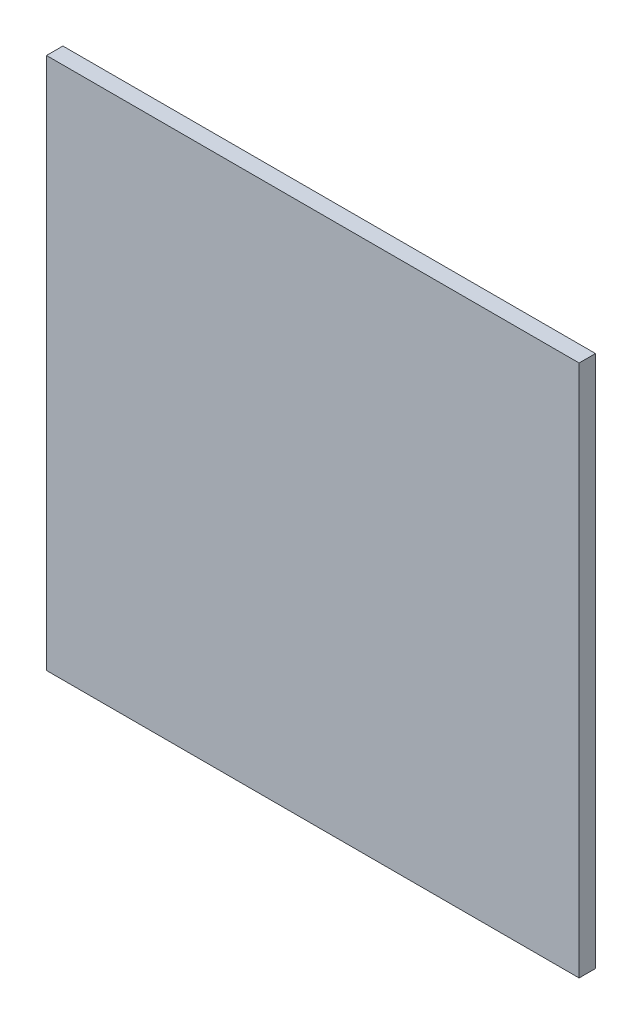
ISO-10303-21;
HEADER;
FILE_DESCRIPTION(('STEP AP214'),'2;1');
FILE_NAME('part.step','',(''),(''),'','','');
FILE_SCHEMA(('AUTOMOTIVE_DESIGN { 1 0 10303 214 1 1 1 1 }'));
ENDSEC;
DATA;
#1=APPLICATION_CONTEXT('core data for automotive mechanical design processes');
#2=APPLICATION_PROTOCOL_DEFINITION('international standard','automotive_design',2000,#1);
#3=PRODUCT_CONTEXT('',#1,'mechanical');
#4=PRODUCT('Part','Part','',(#3));
#5=PRODUCT_RELATED_PRODUCT_CATEGORY('part','',(#4));
#6=PRODUCT_DEFINITION_FORMATION('','',#4);
#7=PRODUCT_DEFINITION_CONTEXT('part definition',#1,'design');
#8=PRODUCT_DEFINITION('design','',#6,#7);
#9=PRODUCT_DEFINITION_SHAPE('','',#8);
#10=(LENGTH_UNIT() NAMED_UNIT(*) SI_UNIT(.MILLI.,.METRE.));
#11=(NAMED_UNIT(*) PLANE_ANGLE_UNIT() SI_UNIT($,.RADIAN.));
#12=(NAMED_UNIT(*) SI_UNIT($,.STERADIAN.) SOLID_ANGLE_UNIT());
#13=UNCERTAINTY_MEASURE_WITH_UNIT(LENGTH_MEASURE(1.E-05),#10,'distance_accuracy_value','');
#14=(GEOMETRIC_REPRESENTATION_CONTEXT(3) GLOBAL_UNCERTAINTY_ASSIGNED_CONTEXT((#13)) GLOBAL_UNIT_ASSIGNED_CONTEXT((#10,
#11,#12)) REPRESENTATION_CONTEXT('',''));
#15=CARTESIAN_POINT('',(0.,0.,0.));
#16=DIRECTION('',(0.,0.,1.));
#17=DIRECTION('',(1.,0.,0.));
#18=AXIS2_PLACEMENT_3D('',#15,#16,#17);
#19=CARTESIAN_POINT('',(0.16250158,0.16250158,0.00999998));
#20=DIRECTION('',(0.,0.,1.));
#21=DIRECTION('',(1.,0.,0.));
#22=AXIS2_PLACEMENT_3D('',#19,#20,#21);
#23=PLANE('',#22);
#24=DIRECTION('',(1.,0.,0.));
#25=VECTOR('',#24,1.);
#26=CARTESIAN_POINT('',(-0.16249904,0.16250158,0.00999998));
#27=LINE('',#26,#25);
#28=CARTESIAN_POINT('',(-0.16249904,0.16250158,0.00999998));
#29=VERTEX_POINT('',#28);
#30=CARTESIAN_POINT('',(0.16250158,0.16250158,0.00999998));
#31=VERTEX_POINT('',#30);
#32=EDGE_CURVE('E26',#29,#31,#27,.T.);
#33=ORIENTED_EDGE('',*,*,#32,.F.);
#34=DIRECTION('',(0.,1.,0.));
#35=VECTOR('',#34,1.);
#36=CARTESIAN_POINT('',(-0.16249904,-0.16249904,0.00999998));
#37=LINE('',#36,#35);
#38=CARTESIAN_POINT('',(-0.16249904,-0.16249904,0.00999998));
#39=VERTEX_POINT('',#38);
#40=EDGE_CURVE('E80',#39,#29,#37,.T.);
#41=ORIENTED_EDGE('',*,*,#40,.F.);
#42=DIRECTION('',(-1.,0.,0.));
#43=VECTOR('',#42,1.);
#44=CARTESIAN_POINT('',(0.16250158,-0.16249904,0.00999998));
#45=LINE('',#44,#43);
#46=CARTESIAN_POINT('',(0.16250158,-0.16249904,0.00999998));
#47=VERTEX_POINT('',#46);
#48=EDGE_CURVE('E83',#47,#39,#45,.T.);
#49=ORIENTED_EDGE('',*,*,#48,.F.);
#50=DIRECTION('',(0.,-1.,0.));
#51=VECTOR('',#50,1.);
#52=CARTESIAN_POINT('',(0.16250158,0.16250158,0.00999998));
#53=LINE('',#52,#51);
#54=EDGE_CURVE('E109',#31,#47,#53,.T.);
#55=ORIENTED_EDGE('',*,*,#54,.F.);
#56=EDGE_LOOP('',(#33,#41,#49,#55));
#57=FACE_BOUND('',#56,.T.);
#58=ADVANCED_FACE('F17',(#57),#23,.T.);
#59=CARTESIAN_POINT('',(0.16250158,0.16250158,0.));
#60=DIRECTION('',(0.,0.,1.));
#61=DIRECTION('',(1.,0.,0.));
#62=AXIS2_PLACEMENT_3D('',#59,#60,#61);
#63=PLANE('',#62);
#64=DIRECTION('',(0.,-1.,0.));
#65=VECTOR('',#64,1.);
#66=CARTESIAN_POINT('',(0.16250158,0.16250158,0.));
#67=LINE('',#66,#65);
#68=CARTESIAN_POINT('',(0.16250158,0.16250158,0.));
#69=VERTEX_POINT('',#68);
#70=CARTESIAN_POINT('',(0.16250158,-0.16249904,0.));
#71=VERTEX_POINT('',#70);
#72=EDGE_CURVE('E75',#69,#71,#67,.T.);
#73=ORIENTED_EDGE('',*,*,#72,.T.);
#74=DIRECTION('',(-1.,0.,0.));
#75=VECTOR('',#74,1.);
#76=CARTESIAN_POINT('',(0.16250158,-0.16249904,0.));
#77=LINE('',#76,#75);
#78=CARTESIAN_POINT('',(-0.16249904,-0.16249904,0.));
#79=VERTEX_POINT('',#78);
#80=EDGE_CURVE('E72',#71,#79,#77,.T.);
#81=ORIENTED_EDGE('',*,*,#80,.T.);
#82=DIRECTION('',(0.,1.,0.));
#83=VECTOR('',#82,1.);
#84=CARTESIAN_POINT('',(-0.16249904,-0.16249904,0.));
#85=LINE('',#84,#83);
#86=CARTESIAN_POINT('',(-0.16249904,0.16250158,0.));
#87=VERTEX_POINT('',#86);
#88=EDGE_CURVE('E61',#79,#87,#85,.T.);
#89=ORIENTED_EDGE('',*,*,#88,.T.);
#90=DIRECTION('',(1.,0.,0.));
#91=VECTOR('',#90,1.);
#92=CARTESIAN_POINT('',(-0.16249904,0.16250158,0.));
#93=LINE('',#92,#91);
#94=EDGE_CURVE('E11',#87,#69,#93,.T.);
#95=ORIENTED_EDGE('',*,*,#94,.T.);
#96=EDGE_LOOP('',(#73,#81,#89,#95));
#97=FACE_BOUND('',#96,.T.);
#98=ADVANCED_FACE('F73',(#97),#63,.F.);
#99=CARTESIAN_POINT('',(-0.16249904,0.16250158,0.));
#100=DIRECTION('',(0.,1.,0.));
#101=DIRECTION('',(1.,0.,0.));
#102=AXIS2_PLACEMENT_3D('',#99,#100,#101);
#103=PLANE('',#102);
#104=DIRECTION('',(0.,0.,1.));
#105=VECTOR('',#104,1.);
#106=CARTESIAN_POINT('',(-0.16249904,0.16250158,0.));
#107=LINE('',#106,#105);
#108=EDGE_CURVE('E68',#87,#29,#107,.T.);
#109=ORIENTED_EDGE('',*,*,#108,.T.);
#110=ORIENTED_EDGE('',*,*,#32,.T.);
#111=DIRECTION('',(0.,0.,1.));
#112=VECTOR('',#111,1.);
#113=CARTESIAN_POINT('',(0.16250158,0.16250158,0.));
#114=LINE('',#113,#112);
#115=EDGE_CURVE('E114',#69,#31,#114,.T.);
#116=ORIENTED_EDGE('',*,*,#115,.F.);
#117=ORIENTED_EDGE('',*,*,#94,.F.);
#118=EDGE_LOOP('',(#109,#110,#116,#117));
#119=FACE_BOUND('',#118,.T.);
#120=ADVANCED_FACE('F105',(#119),#103,.T.);
#121=CARTESIAN_POINT('',(-0.16249904,-0.16249904,0.));
#122=DIRECTION('',(-1.,0.,0.));
#123=DIRECTION('',(0.,0.,1.));
#124=AXIS2_PLACEMENT_3D('',#121,#122,#123);
#125=PLANE('',#124);
#126=DIRECTION('',(0.,0.,1.));
#127=VECTOR('',#126,1.);
#128=CARTESIAN_POINT('',(-0.16249904,-0.16249904,0.));
#129=LINE('',#128,#127);
#130=EDGE_CURVE('E66',#79,#39,#129,.T.);
#131=ORIENTED_EDGE('',*,*,#130,.T.);
#132=ORIENTED_EDGE('',*,*,#40,.T.);
#133=ORIENTED_EDGE('',*,*,#108,.F.);
#134=ORIENTED_EDGE('',*,*,#88,.F.);
#135=EDGE_LOOP('',(#131,#132,#133,#134));
#136=FACE_BOUND('',#135,.T.);
#137=ADVANCED_FACE('F63',(#136),#125,.T.);
#138=CARTESIAN_POINT('',(0.16250158,-0.16249904,0.));
#139=DIRECTION('',(0.,-1.,0.));
#140=DIRECTION('',(0.,0.,-1.));
#141=AXIS2_PLACEMENT_3D('',#138,#139,#140);
#142=PLANE('',#141);
#143=DIRECTION('',(0.,0.,1.));
#144=VECTOR('',#143,1.);
#145=CARTESIAN_POINT('',(0.16250158,-0.16249904,0.));
#146=LINE('',#145,#144);
#147=EDGE_CURVE('E93',#71,#47,#146,.T.);
#148=ORIENTED_EDGE('',*,*,#147,.T.);
#149=ORIENTED_EDGE('',*,*,#48,.T.);
#150=ORIENTED_EDGE('',*,*,#130,.F.);
#151=ORIENTED_EDGE('',*,*,#80,.F.);
#152=EDGE_LOOP('',(#148,#149,#150,#151));
#153=FACE_BOUND('',#152,.T.);
#154=ADVANCED_FACE('F82',(#153),#142,.T.);
#155=CARTESIAN_POINT('',(0.16250158,0.16250158,0.));
#156=DIRECTION('',(1.,0.,0.));
#157=DIRECTION('',(0.,1.,0.));
#158=AXIS2_PLACEMENT_3D('',#155,#156,#157);
#159=PLANE('',#158);
#160=ORIENTED_EDGE('',*,*,#115,.T.);
#161=ORIENTED_EDGE('',*,*,#54,.T.);
#162=ORIENTED_EDGE('',*,*,#147,.F.);
#163=ORIENTED_EDGE('',*,*,#72,.F.);
#164=EDGE_LOOP('',(#160,#161,#162,#163));
#165=FACE_BOUND('',#164,.T.);
#166=ADVANCED_FACE('F115',(#165),#159,.T.);
#167=CLOSED_SHELL('',(#58,#98,#120,#137,#154,#166));
#168=MANIFOLD_SOLID_BREP('B1',#167);
#169=ADVANCED_BREP_SHAPE_REPRESENTATION('',(#18,#168),#14);
#170=SHAPE_DEFINITION_REPRESENTATION(#9,#169);
ENDSEC;
END-ISO-10303-21;
